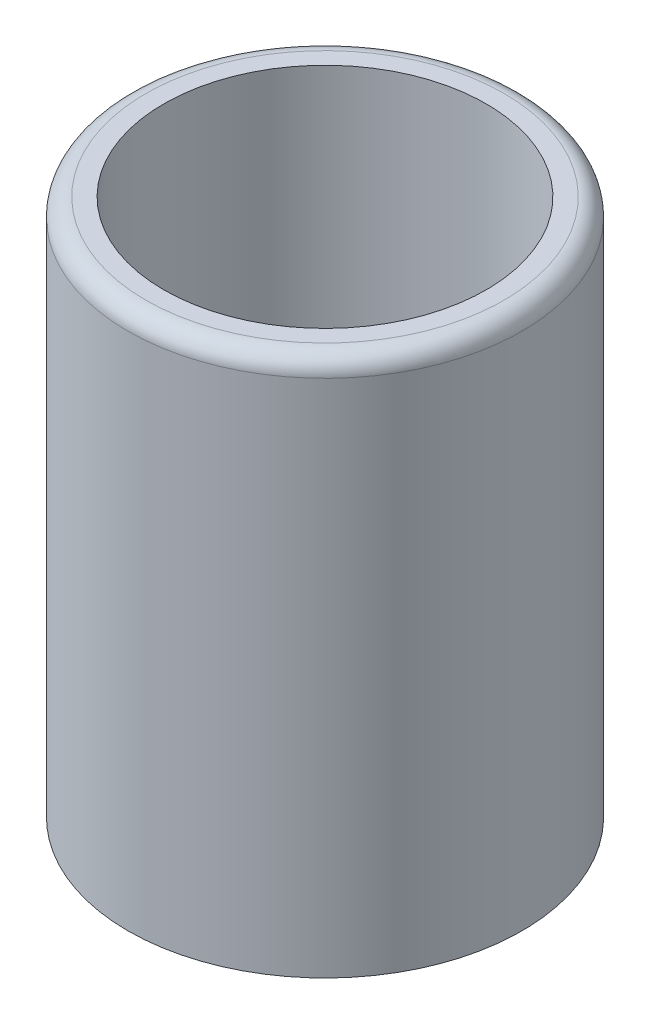
ISO-10303-21;
HEADER;
FILE_DESCRIPTION(('STEP AP214'),'2;1');
FILE_NAME('part.step','',(''),(''),'','','');
FILE_SCHEMA(('AUTOMOTIVE_DESIGN { 1 0 10303 214 1 1 1 1 }'));
ENDSEC;
DATA;
#1=APPLICATION_CONTEXT('core data for automotive mechanical design processes');
#2=APPLICATION_PROTOCOL_DEFINITION('international standard','automotive_design',2000,#1);
#3=PRODUCT_CONTEXT('',#1,'mechanical');
#4=PRODUCT('Part','Part','',(#3));
#5=PRODUCT_RELATED_PRODUCT_CATEGORY('part','',(#4));
#6=PRODUCT_DEFINITION_FORMATION('','',#4);
#7=PRODUCT_DEFINITION_CONTEXT('part definition',#1,'design');
#8=PRODUCT_DEFINITION('design','',#6,#7);
#9=PRODUCT_DEFINITION_SHAPE('','',#8);
#10=(LENGTH_UNIT() NAMED_UNIT(*) SI_UNIT(.MILLI.,.METRE.));
#11=(NAMED_UNIT(*) PLANE_ANGLE_UNIT() SI_UNIT($,.RADIAN.));
#12=(NAMED_UNIT(*) SI_UNIT($,.STERADIAN.) SOLID_ANGLE_UNIT());
#13=UNCERTAINTY_MEASURE_WITH_UNIT(LENGTH_MEASURE(1.E-05),#10,'distance_accuracy_value','');
#14=(GEOMETRIC_REPRESENTATION_CONTEXT(3) GLOBAL_UNCERTAINTY_ASSIGNED_CONTEXT((#13)) GLOBAL_UNIT_ASSIGNED_CONTEXT((#10,
#11,#12)) REPRESENTATION_CONTEXT('',''));
#15=CARTESIAN_POINT('',(0.,0.,0.));
#16=DIRECTION('',(0.,0.,1.));
#17=DIRECTION('',(1.,0.,0.));
#18=AXIS2_PLACEMENT_3D('',#15,#16,#17);
#19=CARTESIAN_POINT('',(0.,30.,0.));
#20=DIRECTION('',(0.,-1.,0.));
#21=DIRECTION('',(0.,0.,-1.));
#22=AXIS2_PLACEMENT_3D('',#19,#20,#21);
#23=CYLINDRICAL_SURFACE('',#22,11.);
#24=CARTESIAN_POINT('',(0.,29.,0.));
#25=DIRECTION('',(0.,1.,0.));
#26=DIRECTION('',(0.,0.,1.));
#27=AXIS2_PLACEMENT_3D('',#24,#25,#26);
#28=CIRCLE('',#27,11.);
#29=CARTESIAN_POINT('',(0.,29.,11.));
#30=VERTEX_POINT('',#29);
#31=EDGE_CURVE('E10',#30,#30,#28,.F.);
#32=ORIENTED_EDGE('',*,*,#31,.T.);
#33=EDGE_LOOP('',(#32));
#34=FACE_BOUND('',#33,.T.);
#35=CARTESIAN_POINT('',(0.,0.,0.));
#36=DIRECTION('',(0.,1.,0.));
#37=DIRECTION('',(0.,0.,1.));
#38=AXIS2_PLACEMENT_3D('',#35,#36,#37);
#39=CIRCLE('',#38,11.);
#40=CARTESIAN_POINT('',(0.,0.,11.));
#41=VERTEX_POINT('',#40);
#42=EDGE_CURVE('E42',#41,#41,#39,.T.);
#43=ORIENTED_EDGE('',*,*,#42,.T.);
#44=EDGE_LOOP('',(#43));
#45=FACE_BOUND('',#44,.T.);
#46=ADVANCED_FACE('F31',(#34,#45),#23,.T.);
#47=CARTESIAN_POINT('',(0.,30.,0.));
#48=DIRECTION('',(0.,1.,0.));
#49=DIRECTION('',(0.,0.,1.));
#50=AXIS2_PLACEMENT_3D('',#47,#48,#49);
#51=PLANE('',#50);
#52=CARTESIAN_POINT('',(0.,30.,0.));
#53=DIRECTION('',(0.,1.,0.));
#54=DIRECTION('',(0.,0.,1.));
#55=AXIS2_PLACEMENT_3D('',#52,#53,#54);
#56=CIRCLE('',#55,10.);
#57=CARTESIAN_POINT('',(0.,30.,10.));
#58=VERTEX_POINT('',#57);
#59=EDGE_CURVE('E38',#58,#58,#56,.T.);
#60=ORIENTED_EDGE('',*,*,#59,.T.);
#61=EDGE_LOOP('',(#60));
#62=FACE_BOUND('',#61,.T.);
#63=CARTESIAN_POINT('',(0.,30.,0.));
#64=DIRECTION('',(0.,1.,0.));
#65=DIRECTION('',(0.,0.,1.));
#66=AXIS2_PLACEMENT_3D('',#63,#64,#65);
#67=CIRCLE('',#66,9.);
#68=CARTESIAN_POINT('',(0.,30.,9.));
#69=VERTEX_POINT('',#68);
#70=EDGE_CURVE('E46',#69,#69,#67,.T.);
#71=ORIENTED_EDGE('',*,*,#70,.F.);
#72=EDGE_LOOP('',(#71));
#73=FACE_BOUND('',#72,.T.);
#74=ADVANCED_FACE('F67',(#62,#73),#51,.T.);
#75=CARTESIAN_POINT('',(0.,0.,0.));
#76=DIRECTION('',(0.,1.,0.));
#77=DIRECTION('',(0.,0.,1.));
#78=AXIS2_PLACEMENT_3D('',#75,#76,#77);
#79=PLANE('',#78);
#80=ORIENTED_EDGE('',*,*,#42,.F.);
#81=EDGE_LOOP('',(#80));
#82=FACE_BOUND('',#81,.T.);
#83=ADVANCED_FACE('F59',(#82),#79,.F.);
#84=CARTESIAN_POINT('',(0.,30.,0.));
#85=DIRECTION('',(0.,-1.,0.));
#86=DIRECTION('',(0.,0.,-1.));
#87=AXIS2_PLACEMENT_3D('',#84,#85,#86);
#88=CYLINDRICAL_SURFACE('',#87,9.);
#89=ORIENTED_EDGE('',*,*,#70,.T.);
#90=EDGE_LOOP('',(#89));
#91=FACE_BOUND('',#90,.T.);
#92=CARTESIAN_POINT('',(0.,2.,0.));
#93=DIRECTION('',(0.,1.,0.));
#94=DIRECTION('',(0.,0.,1.));
#95=AXIS2_PLACEMENT_3D('',#92,#93,#94);
#96=CIRCLE('',#95,9.);
#97=CARTESIAN_POINT('',(0.,2.,9.));
#98=VERTEX_POINT('',#97);
#99=EDGE_CURVE('E51',#98,#98,#96,.T.);
#100=ORIENTED_EDGE('',*,*,#99,.F.);
#101=EDGE_LOOP('',(#100));
#102=FACE_BOUND('',#101,.T.);
#103=ADVANCED_FACE('F57',(#91,#102),#88,.F.);
#104=CARTESIAN_POINT('',(0.,2.,0.));
#105=DIRECTION('',(0.,1.,0.));
#106=DIRECTION('',(0.,0.,1.));
#107=AXIS2_PLACEMENT_3D('',#104,#105,#106);
#108=PLANE('',#107);
#109=ORIENTED_EDGE('',*,*,#99,.T.);
#110=EDGE_LOOP('',(#109));
#111=FACE_BOUND('',#110,.T.);
#112=ADVANCED_FACE('F55',(#111),#108,.T.);
#113=CARTESIAN_POINT('',(0.,29.,0.));
#114=DIRECTION('',(0.,1.,0.));
#115=DIRECTION('',(0.,0.,1.));
#116=AXIS2_PLACEMENT_3D('',#113,#114,#115);
#117=TOROIDAL_SURFACE('',#116,10.,1.);
#118=ORIENTED_EDGE('',*,*,#31,.F.);
#119=EDGE_LOOP('',(#118));
#120=FACE_BOUND('',#119,.T.);
#121=ORIENTED_EDGE('',*,*,#59,.F.);
#122=EDGE_LOOP('',(#121));
#123=FACE_BOUND('',#122,.T.);
#124=ADVANCED_FACE('F33',(#120,#123),#117,.T.);
#125=CLOSED_SHELL('',(#46,#74,#83,#103,#112,#124));
#126=MANIFOLD_SOLID_BREP('B2',#125);
#127=ADVANCED_BREP_SHAPE_REPRESENTATION('',(#18,#126),#14);
#128=SHAPE_DEFINITION_REPRESENTATION(#9,#127);
ENDSEC;
END-ISO-10303-21;
